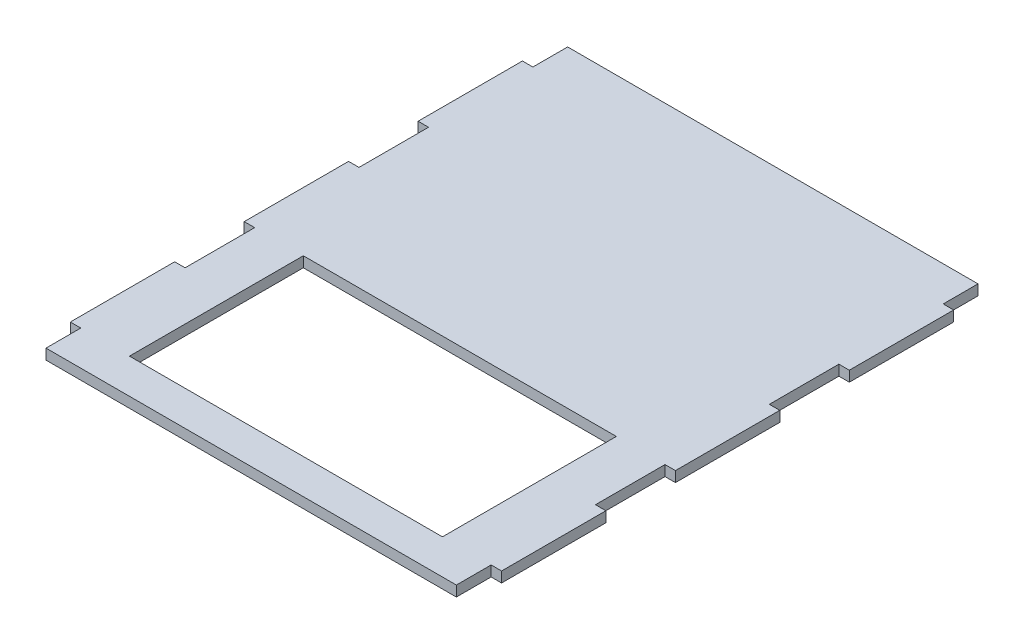
ISO-10303-21;
HEADER;
FILE_DESCRIPTION(('STEP AP214'),'2;1');
FILE_NAME('part.step','',(''),(''),'','','');
FILE_SCHEMA(('AUTOMOTIVE_DESIGN { 1 0 10303 214 1 1 1 1 }'));
ENDSEC;
DATA;
#1=APPLICATION_CONTEXT('core data for automotive mechanical design processes');
#2=APPLICATION_PROTOCOL_DEFINITION('international standard','automotive_design',2000,#1);
#3=PRODUCT_CONTEXT('',#1,'mechanical');
#4=PRODUCT('Part','Part','',(#3));
#5=PRODUCT_RELATED_PRODUCT_CATEGORY('part','',(#4));
#6=PRODUCT_DEFINITION_FORMATION('','',#4);
#7=PRODUCT_DEFINITION_CONTEXT('part definition',#1,'design');
#8=PRODUCT_DEFINITION('design','',#6,#7);
#9=PRODUCT_DEFINITION_SHAPE('','',#8);
#10=(LENGTH_UNIT() NAMED_UNIT(*) SI_UNIT(.MILLI.,.METRE.));
#11=(NAMED_UNIT(*) PLANE_ANGLE_UNIT() SI_UNIT($,.RADIAN.));
#12=(NAMED_UNIT(*) SI_UNIT($,.STERADIAN.) SOLID_ANGLE_UNIT());
#13=UNCERTAINTY_MEASURE_WITH_UNIT(LENGTH_MEASURE(1.E-05),#10,'distance_accuracy_value','');
#14=(GEOMETRIC_REPRESENTATION_CONTEXT(3) GLOBAL_UNCERTAINTY_ASSIGNED_CONTEXT((#13)) GLOBAL_UNIT_ASSIGNED_CONTEXT((#10,
#11,#12)) REPRESENTATION_CONTEXT('',''));
#15=CARTESIAN_POINT('',(0.,0.,0.));
#16=DIRECTION('',(0.,0.,1.));
#17=DIRECTION('',(1.,0.,0.));
#18=AXIS2_PLACEMENT_3D('',#15,#16,#17);
#19=CARTESIAN_POINT('',(0.,3.,0.));
#20=DIRECTION('',(0.,1.,0.));
#21=DIRECTION('',(0.,0.,1.));
#22=AXIS2_PLACEMENT_3D('',#19,#20,#21);
#23=PLANE('',#22);
#24=DIRECTION('',(0.,0.,-1.));
#25=VECTOR('',#24,1.);
#26=CARTESIAN_POINT('',(1.02695629777827E-12,3.,9.99999999999969));
#27=LINE('',#26,#25);
#28=CARTESIAN_POINT('',(1.02695629777827E-12,3.,9.99999999999969));
#29=VERTEX_POINT('',#28);
#30=CARTESIAN_POINT('',(1.02695629777827E-12,3.,0.));
#31=VERTEX_POINT('',#30);
#32=EDGE_CURVE('E278',#29,#31,#27,.T.);
#33=ORIENTED_EDGE('',*,*,#32,.T.);
#34=DIRECTION('',(-1.,0.,0.));
#35=VECTOR('',#34,1.);
#36=CARTESIAN_POINT('',(1.02695629777827E-12,3.,0.));
#37=LINE('',#36,#35);
#38=CARTESIAN_POINT('',(-117.999999999999,3.,0.));
#39=VERTEX_POINT('',#38);
#40=EDGE_CURVE('E281',#31,#39,#37,.T.);
#41=ORIENTED_EDGE('',*,*,#40,.T.);
#42=DIRECTION('',(0.,0.,-1.));
#43=VECTOR('',#42,1.);
#44=CARTESIAN_POINT('',(-117.999999999999,3.,10.));
#45=LINE('',#44,#43);
#46=CARTESIAN_POINT('',(-117.999999999999,3.,10.));
#47=VERTEX_POINT('',#46);
#48=EDGE_CURVE('E284',#47,#39,#45,.T.);
#49=ORIENTED_EDGE('',*,*,#48,.F.);
#50=DIRECTION('',(-1.,0.,0.));
#51=VECTOR('',#50,1.);
#52=CARTESIAN_POINT('',(-117.999999999999,3.,10.));
#53=LINE('',#52,#51);
#54=CARTESIAN_POINT('',(-120.999999999999,3.,10.));
#55=VERTEX_POINT('',#54);
#56=EDGE_CURVE('E287',#47,#55,#53,.T.);
#57=ORIENTED_EDGE('',*,*,#56,.T.);
#58=DIRECTION('',(0.,0.,-1.));
#59=VECTOR('',#58,1.);
#60=CARTESIAN_POINT('',(-120.999999999999,3.,40.));
#61=LINE('',#60,#59);
#62=CARTESIAN_POINT('',(-120.999999999999,3.,40.));
#63=VERTEX_POINT('',#62);
#64=EDGE_CURVE('E289',#63,#55,#61,.T.);
#65=ORIENTED_EDGE('',*,*,#64,.F.);
#66=DIRECTION('',(-1.,0.,0.));
#67=VECTOR('',#66,1.);
#68=CARTESIAN_POINT('',(-117.999999999999,3.,40.));
#69=LINE('',#68,#67);
#70=CARTESIAN_POINT('',(-117.999999999999,3.,40.));
#71=VERTEX_POINT('',#70);
#72=EDGE_CURVE('E292',#71,#63,#69,.T.);
#73=ORIENTED_EDGE('',*,*,#72,.F.);
#74=DIRECTION('',(0.,0.,-1.));
#75=VECTOR('',#74,1.);
#76=CARTESIAN_POINT('',(-118.,3.,50.0000000000001));
#77=LINE('',#76,#75);
#78=CARTESIAN_POINT('',(-118.,3.,60.));
#79=VERTEX_POINT('',#78);
#80=EDGE_CURVE('E295',#79,#71,#77,.T.);
#81=ORIENTED_EDGE('',*,*,#80,.F.);
#82=DIRECTION('',(-1.,0.,0.));
#83=VECTOR('',#82,1.);
#84=CARTESIAN_POINT('',(-118.,3.,60.));
#85=LINE('',#84,#83);
#86=CARTESIAN_POINT('',(-120.999999999997,3.,60.));
#87=VERTEX_POINT('',#86);
#88=EDGE_CURVE('E298',#79,#87,#85,.T.);
#89=ORIENTED_EDGE('',*,*,#88,.T.);
#90=DIRECTION('',(0.,0.,-1.));
#91=VECTOR('',#90,1.);
#92=CARTESIAN_POINT('',(-120.999999999997,3.,90.));
#93=LINE('',#92,#91);
#94=CARTESIAN_POINT('',(-120.999999999997,3.,90.));
#95=VERTEX_POINT('',#94);
#96=EDGE_CURVE('E300',#95,#87,#93,.T.);
#97=ORIENTED_EDGE('',*,*,#96,.F.);
#98=DIRECTION('',(-1.,0.,0.));
#99=VECTOR('',#98,1.);
#100=CARTESIAN_POINT('',(-118.,3.,90.));
#101=LINE('',#100,#99);
#102=CARTESIAN_POINT('',(-118.,3.,90.));
#103=VERTEX_POINT('',#102);
#104=EDGE_CURVE('E303',#103,#95,#101,.T.);
#105=ORIENTED_EDGE('',*,*,#104,.F.);
#106=DIRECTION('',(0.,0.,-1.));
#107=VECTOR('',#106,1.);
#108=CARTESIAN_POINT('',(-118.,3.,100.));
#109=LINE('',#108,#107);
#110=CARTESIAN_POINT('',(-118.,3.,110.));
#111=VERTEX_POINT('',#110);
#112=EDGE_CURVE('E306',#111,#103,#109,.T.);
#113=ORIENTED_EDGE('',*,*,#112,.F.);
#114=DIRECTION('',(-1.,0.,0.));
#115=VECTOR('',#114,1.);
#116=CARTESIAN_POINT('',(-118.,3.,110.));
#117=LINE('',#116,#115);
#118=CARTESIAN_POINT('',(-121.,3.,110.));
#119=VERTEX_POINT('',#118);
#120=EDGE_CURVE('E309',#111,#119,#117,.T.);
#121=ORIENTED_EDGE('',*,*,#120,.T.);
#122=DIRECTION('',(0.,0.,-1.));
#123=VECTOR('',#122,1.);
#124=CARTESIAN_POINT('',(-121.,3.,140.));
#125=LINE('',#124,#123);
#126=CARTESIAN_POINT('',(-121.,3.,140.));
#127=VERTEX_POINT('',#126);
#128=EDGE_CURVE('E311',#127,#119,#125,.T.);
#129=ORIENTED_EDGE('',*,*,#128,.F.);
#130=DIRECTION('',(-1.,0.,0.));
#131=VECTOR('',#130,1.);
#132=CARTESIAN_POINT('',(-118.,3.,140.));
#133=LINE('',#132,#131);
#134=CARTESIAN_POINT('',(-118.,3.,140.));
#135=VERTEX_POINT('',#134);
#136=EDGE_CURVE('E314',#135,#127,#133,.T.);
#137=ORIENTED_EDGE('',*,*,#136,.F.);
#138=DIRECTION('',(0.,0.,-1.));
#139=VECTOR('',#138,1.);
#140=CARTESIAN_POINT('',(-118.,3.,150.));
#141=LINE('',#140,#139);
#142=CARTESIAN_POINT('',(-118.,3.,150.));
#143=VERTEX_POINT('',#142);
#144=EDGE_CURVE('E317',#143,#135,#141,.T.);
#145=ORIENTED_EDGE('',*,*,#144,.F.);
#146=DIRECTION('',(-1.,0.,0.));
#147=VECTOR('',#146,1.);
#148=CARTESIAN_POINT('',(0.,3.,150.));
#149=LINE('',#148,#147);
#150=CARTESIAN_POINT('',(0.,3.,150.));
#151=VERTEX_POINT('',#150);
#152=EDGE_CURVE('E320',#151,#143,#149,.T.);
#153=ORIENTED_EDGE('',*,*,#152,.F.);
#154=DIRECTION('',(0.,0.,-1.));
#155=VECTOR('',#154,1.);
#156=CARTESIAN_POINT('',(0.,3.,150.));
#157=LINE('',#156,#155);
#158=CARTESIAN_POINT('',(0.,3.,140.));
#159=VERTEX_POINT('',#158);
#160=EDGE_CURVE('E323',#151,#159,#157,.T.);
#161=ORIENTED_EDGE('',*,*,#160,.T.);
#162=DIRECTION('',(1.,0.,0.));
#163=VECTOR('',#162,1.);
#164=CARTESIAN_POINT('',(0.,3.,140.));
#165=LINE('',#164,#163);
#166=CARTESIAN_POINT('',(3.00000000000017,3.,140.));
#167=VERTEX_POINT('',#166);
#168=EDGE_CURVE('E325',#159,#167,#165,.T.);
#169=ORIENTED_EDGE('',*,*,#168,.T.);
#170=DIRECTION('',(0.,0.,-1.));
#171=VECTOR('',#170,1.);
#172=CARTESIAN_POINT('',(3.00000000000017,3.,140.));
#173=LINE('',#172,#171);
#174=CARTESIAN_POINT('',(3.00000000000017,3.,110.));
#175=VERTEX_POINT('',#174);
#176=EDGE_CURVE('E327',#167,#175,#173,.T.);
#177=ORIENTED_EDGE('',*,*,#176,.T.);
#178=DIRECTION('',(1.,0.,0.));
#179=VECTOR('',#178,1.);
#180=CARTESIAN_POINT('',(0.,3.,110.));
#181=LINE('',#180,#179);
#182=CARTESIAN_POINT('',(0.,3.,110.));
#183=VERTEX_POINT('',#182);
#184=EDGE_CURVE('E329',#183,#175,#181,.T.);
#185=ORIENTED_EDGE('',*,*,#184,.F.);
#186=DIRECTION('',(0.,0.,-1.));
#187=VECTOR('',#186,1.);
#188=CARTESIAN_POINT('',(0.,3.,110.));
#189=LINE('',#188,#187);
#190=CARTESIAN_POINT('',(0.,3.,89.9999999999997));
#191=VERTEX_POINT('',#190);
#192=EDGE_CURVE('E332',#183,#191,#189,.T.);
#193=ORIENTED_EDGE('',*,*,#192,.T.);
#194=DIRECTION('',(1.,0.,0.));
#195=VECTOR('',#194,1.);
#196=CARTESIAN_POINT('',(0.,3.,89.9999999999997));
#197=LINE('',#196,#195);
#198=CARTESIAN_POINT('',(2.99999999999681,3.,89.9999999999997));
#199=VERTEX_POINT('',#198);
#200=EDGE_CURVE('E334',#191,#199,#197,.T.);
#201=ORIENTED_EDGE('',*,*,#200,.T.);
#202=DIRECTION('',(0.,0.,-1.));
#203=VECTOR('',#202,1.);
#204=CARTESIAN_POINT('',(2.99999999999681,3.,89.9999999999997));
#205=LINE('',#204,#203);
#206=CARTESIAN_POINT('',(2.99999999999681,3.,59.9999999999997));
#207=VERTEX_POINT('',#206);
#208=EDGE_CURVE('E336',#199,#207,#205,.T.);
#209=ORIENTED_EDGE('',*,*,#208,.T.);
#210=DIRECTION('',(1.,0.,0.));
#211=VECTOR('',#210,1.);
#212=CARTESIAN_POINT('',(-3.3584246494911E-12,3.,59.9999999999997));
#213=LINE('',#212,#211);
#214=CARTESIAN_POINT('',(-3.3584246494911E-12,3.,59.9999999999997));
#215=VERTEX_POINT('',#214);
#216=EDGE_CURVE('E338',#215,#207,#213,.T.);
#217=ORIENTED_EDGE('',*,*,#216,.F.);
#218=DIRECTION('',(0.,0.,-1.));
#219=VECTOR('',#218,1.);
#220=CARTESIAN_POINT('',(-3.3584246494911E-12,3.,59.9999999999997));
#221=LINE('',#220,#219);
#222=CARTESIAN_POINT('',(-3.3584246494911E-12,3.,39.9999999999997));
#223=VERTEX_POINT('',#222);
#224=EDGE_CURVE('E341',#215,#223,#221,.T.);
#225=ORIENTED_EDGE('',*,*,#224,.T.);
#226=DIRECTION('',(1.,0.,0.));
#227=VECTOR('',#226,1.);
#228=CARTESIAN_POINT('',(-3.3584246494911E-12,3.,39.9999999999997));
#229=LINE('',#228,#227);
#230=CARTESIAN_POINT('',(2.99999999999606,3.,39.9999999999997));
#231=VERTEX_POINT('',#230);
#232=EDGE_CURVE('E343',#223,#231,#229,.T.);
#233=ORIENTED_EDGE('',*,*,#232,.T.);
#234=DIRECTION('',(0.,0.,-1.));
#235=VECTOR('',#234,1.);
#236=CARTESIAN_POINT('',(2.99999999999606,3.,39.9999999999997));
#237=LINE('',#236,#235);
#238=CARTESIAN_POINT('',(2.99999999999606,3.,9.99999999999969));
#239=VERTEX_POINT('',#238);
#240=EDGE_CURVE('E345',#231,#239,#237,.T.);
#241=ORIENTED_EDGE('',*,*,#240,.T.);
#242=DIRECTION('',(1.,0.,0.));
#243=VECTOR('',#242,1.);
#244=CARTESIAN_POINT('',(1.02695629777827E-12,3.,9.99999999999969));
#245=LINE('',#244,#243);
#246=EDGE_CURVE('E347',#29,#239,#245,.T.);
#247=ORIENTED_EDGE('',*,*,#246,.F.);
#248=EDGE_LOOP('',(#33,#41,#49,#57,#65,#73,#81,#89,#97,#105,#113,#121,#129,#137,#145,#153,#161,
#169,#177,#185,#193,#201,#209,#217,#225,#233,#241,#247));
#249=FACE_BOUND('',#248,.T.);
#250=DIRECTION('',(0.,0.,-1.));
#251=VECTOR('',#250,1.);
#252=CARTESIAN_POINT('',(-13.9999999999999,3.,140.));
#253=LINE('',#252,#251);
#254=CARTESIAN_POINT('',(-13.9999999999999,3.,140.));
#255=VERTEX_POINT('',#254);
#256=CARTESIAN_POINT('',(-13.9999999999999,3.,90.));
#257=VERTEX_POINT('',#256);
#258=EDGE_CURVE('E252',#255,#257,#253,.T.);
#259=ORIENTED_EDGE('',*,*,#258,.F.);
#260=DIRECTION('',(1.,0.,0.));
#261=VECTOR('',#260,1.);
#262=CARTESIAN_POINT('',(-104.,3.,140.));
#263=LINE('',#262,#261);
#264=CARTESIAN_POINT('',(-104.,3.,140.));
#265=VERTEX_POINT('',#264);
#266=EDGE_CURVE('E243',#265,#255,#263,.T.);
#267=ORIENTED_EDGE('',*,*,#266,.F.);
#268=DIRECTION('',(0.,0.,-1.));
#269=VECTOR('',#268,1.);
#270=CARTESIAN_POINT('',(-104.,3.,140.));
#271=LINE('',#270,#269);
#272=CARTESIAN_POINT('',(-104.,3.,90.));
#273=VERTEX_POINT('',#272);
#274=EDGE_CURVE('E263',#265,#273,#271,.T.);
#275=ORIENTED_EDGE('',*,*,#274,.T.);
#276=DIRECTION('',(1.,0.,0.));
#277=VECTOR('',#276,1.);
#278=CARTESIAN_POINT('',(-104.,3.,90.));
#279=LINE('',#278,#277);
#280=EDGE_CURVE('E49',#273,#257,#279,.T.);
#281=ORIENTED_EDGE('',*,*,#280,.T.);
#282=EDGE_LOOP('',(#259,#267,#275,#281));
#283=FACE_BOUND('',#282,.T.);
#284=ADVANCED_FACE('F34',(#249,#283),#23,.T.);
#285=CARTESIAN_POINT('',(0.,0.,0.));
#286=DIRECTION('',(0.,1.,0.));
#287=DIRECTION('',(0.,0.,1.));
#288=AXIS2_PLACEMENT_3D('',#285,#286,#287);
#289=PLANE('',#288);
#290=DIRECTION('',(0.,0.,-1.));
#291=VECTOR('',#290,1.);
#292=CARTESIAN_POINT('',(1.02695629777827E-12,0.,9.99999999999969));
#293=LINE('',#292,#291);
#294=CARTESIAN_POINT('',(1.02695629777827E-12,0.,9.99999999999969));
#295=VERTEX_POINT('',#294);
#296=CARTESIAN_POINT('',(1.02695629777827E-12,0.,0.));
#297=VERTEX_POINT('',#296);
#298=EDGE_CURVE('E259',#295,#297,#293,.T.);
#299=ORIENTED_EDGE('',*,*,#298,.F.);
#300=DIRECTION('',(1.,0.,0.));
#301=VECTOR('',#300,1.);
#302=CARTESIAN_POINT('',(1.02695629777827E-12,0.,9.99999999999969));
#303=LINE('',#302,#301);
#304=CARTESIAN_POINT('',(2.99999999999606,0.,9.99999999999969));
#305=VERTEX_POINT('',#304);
#306=EDGE_CURVE('E282',#295,#305,#303,.T.);
#307=ORIENTED_EDGE('',*,*,#306,.T.);
#308=DIRECTION('',(0.,0.,-1.));
#309=VECTOR('',#308,1.);
#310=CARTESIAN_POINT('',(2.99999999999606,0.,39.9999999999997));
#311=LINE('',#310,#309);
#312=CARTESIAN_POINT('',(2.99999999999606,0.,39.9999999999997));
#313=VERTEX_POINT('',#312);
#314=EDGE_CURVE('E420',#313,#305,#311,.T.);
#315=ORIENTED_EDGE('',*,*,#314,.F.);
#316=DIRECTION('',(1.,0.,0.));
#317=VECTOR('',#316,1.);
#318=CARTESIAN_POINT('',(-3.3584246494911E-12,0.,39.9999999999997));
#319=LINE('',#318,#317);
#320=CARTESIAN_POINT('',(-3.3584246494911E-12,0.,39.9999999999997));
#321=VERTEX_POINT('',#320);
#322=EDGE_CURVE('E418',#321,#313,#319,.T.);
#323=ORIENTED_EDGE('',*,*,#322,.F.);
#324=DIRECTION('',(0.,0.,-1.));
#325=VECTOR('',#324,1.);
#326=CARTESIAN_POINT('',(-3.3584246494911E-12,0.,49.9999999999997));
#327=LINE('',#326,#325);
#328=CARTESIAN_POINT('',(-3.3584246494911E-12,0.,59.9999999999997));
#329=VERTEX_POINT('',#328);
#330=EDGE_CURVE('E416',#329,#321,#327,.T.);
#331=ORIENTED_EDGE('',*,*,#330,.F.);
#332=DIRECTION('',(1.,0.,0.));
#333=VECTOR('',#332,1.);
#334=CARTESIAN_POINT('',(-3.3584246494911E-12,0.,59.9999999999997));
#335=LINE('',#334,#333);
#336=CARTESIAN_POINT('',(2.99999999999681,0.,59.9999999999997));
#337=VERTEX_POINT('',#336);
#338=EDGE_CURVE('E413',#329,#337,#335,.T.);
#339=ORIENTED_EDGE('',*,*,#338,.T.);
#340=DIRECTION('',(0.,0.,-1.));
#341=VECTOR('',#340,1.);
#342=CARTESIAN_POINT('',(2.99999999999681,0.,89.9999999999997));
#343=LINE('',#342,#341);
#344=CARTESIAN_POINT('',(2.99999999999681,0.,89.9999999999997));
#345=VERTEX_POINT('',#344);
#346=EDGE_CURVE('E410',#345,#337,#343,.T.);
#347=ORIENTED_EDGE('',*,*,#346,.F.);
#348=DIRECTION('',(1.,0.,0.));
#349=VECTOR('',#348,1.);
#350=CARTESIAN_POINT('',(0.,0.,89.9999999999997));
#351=LINE('',#350,#349);
#352=CARTESIAN_POINT('',(0.,0.,89.9999999999997));
#353=VERTEX_POINT('',#352);
#354=EDGE_CURVE('E408',#353,#345,#351,.T.);
#355=ORIENTED_EDGE('',*,*,#354,.F.);
#356=DIRECTION('',(0.,0.,-1.));
#357=VECTOR('',#356,1.);
#358=CARTESIAN_POINT('',(0.,0.,100.));
#359=LINE('',#358,#357);
#360=CARTESIAN_POINT('',(0.,0.,110.));
#361=VERTEX_POINT('',#360);
#362=EDGE_CURVE('E406',#361,#353,#359,.T.);
#363=ORIENTED_EDGE('',*,*,#362,.F.);
#364=DIRECTION('',(1.,0.,0.));
#365=VECTOR('',#364,1.);
#366=CARTESIAN_POINT('',(0.,0.,110.));
#367=LINE('',#366,#365);
#368=CARTESIAN_POINT('',(3.00000000000017,0.,110.));
#369=VERTEX_POINT('',#368);
#370=EDGE_CURVE('E403',#361,#369,#367,.T.);
#371=ORIENTED_EDGE('',*,*,#370,.T.);
#372=DIRECTION('',(0.,0.,-1.));
#373=VECTOR('',#372,1.);
#374=CARTESIAN_POINT('',(3.00000000000017,0.,140.));
#375=LINE('',#374,#373);
#376=CARTESIAN_POINT('',(3.00000000000017,0.,140.));
#377=VERTEX_POINT('',#376);
#378=EDGE_CURVE('E400',#377,#369,#375,.T.);
#379=ORIENTED_EDGE('',*,*,#378,.F.);
#380=DIRECTION('',(1.,0.,0.));
#381=VECTOR('',#380,1.);
#382=CARTESIAN_POINT('',(0.,0.,140.));
#383=LINE('',#382,#381);
#384=CARTESIAN_POINT('',(0.,0.,140.));
#385=VERTEX_POINT('',#384);
#386=EDGE_CURVE('E398',#385,#377,#383,.T.);
#387=ORIENTED_EDGE('',*,*,#386,.F.);
#388=DIRECTION('',(0.,0.,-1.));
#389=VECTOR('',#388,1.);
#390=CARTESIAN_POINT('',(0.,0.,150.));
#391=LINE('',#390,#389);
#392=CARTESIAN_POINT('',(0.,0.,150.));
#393=VERTEX_POINT('',#392);
#394=EDGE_CURVE('E396',#393,#385,#391,.T.);
#395=ORIENTED_EDGE('',*,*,#394,.F.);
#396=DIRECTION('',(-1.,0.,0.));
#397=VECTOR('',#396,1.);
#398=CARTESIAN_POINT('',(0.,0.,150.));
#399=LINE('',#398,#397);
#400=CARTESIAN_POINT('',(-118.,0.,150.));
#401=VERTEX_POINT('',#400);
#402=EDGE_CURVE('E393',#393,#401,#399,.T.);
#403=ORIENTED_EDGE('',*,*,#402,.T.);
#404=DIRECTION('',(0.,0.,-1.));
#405=VECTOR('',#404,1.);
#406=CARTESIAN_POINT('',(-118.,0.,150.));
#407=LINE('',#406,#405);
#408=CARTESIAN_POINT('',(-118.,0.,140.));
#409=VERTEX_POINT('',#408);
#410=EDGE_CURVE('E390',#401,#409,#407,.T.);
#411=ORIENTED_EDGE('',*,*,#410,.T.);
#412=DIRECTION('',(-1.,0.,0.));
#413=VECTOR('',#412,1.);
#414=CARTESIAN_POINT('',(-118.,0.,140.));
#415=LINE('',#414,#413);
#416=CARTESIAN_POINT('',(-121.,0.,140.));
#417=VERTEX_POINT('',#416);
#418=EDGE_CURVE('E387',#409,#417,#415,.T.);
#419=ORIENTED_EDGE('',*,*,#418,.T.);
#420=DIRECTION('',(0.,0.,-1.));
#421=VECTOR('',#420,1.);
#422=CARTESIAN_POINT('',(-121.,0.,140.));
#423=LINE('',#422,#421);
#424=CARTESIAN_POINT('',(-121.,0.,110.));
#425=VERTEX_POINT('',#424);
#426=EDGE_CURVE('E384',#417,#425,#423,.T.);
#427=ORIENTED_EDGE('',*,*,#426,.T.);
#428=DIRECTION('',(-1.,0.,0.));
#429=VECTOR('',#428,1.);
#430=CARTESIAN_POINT('',(-118.,0.,110.));
#431=LINE('',#430,#429);
#432=CARTESIAN_POINT('',(-118.,0.,110.));
#433=VERTEX_POINT('',#432);
#434=EDGE_CURVE('E381',#433,#425,#431,.T.);
#435=ORIENTED_EDGE('',*,*,#434,.F.);
#436=DIRECTION('',(0.,0.,-1.));
#437=VECTOR('',#436,1.);
#438=CARTESIAN_POINT('',(-118.,0.,110.));
#439=LINE('',#438,#437);
#440=CARTESIAN_POINT('',(-118.,0.,90.));
#441=VERTEX_POINT('',#440);
#442=EDGE_CURVE('E379',#433,#441,#439,.T.);
#443=ORIENTED_EDGE('',*,*,#442,.T.);
#444=DIRECTION('',(-1.,0.,0.));
#445=VECTOR('',#444,1.);
#446=CARTESIAN_POINT('',(-118.,0.,90.));
#447=LINE('',#446,#445);
#448=CARTESIAN_POINT('',(-120.999999999997,0.,90.));
#449=VERTEX_POINT('',#448);
#450=EDGE_CURVE('E376',#441,#449,#447,.T.);
#451=ORIENTED_EDGE('',*,*,#450,.T.);
#452=DIRECTION('',(0.,0.,-1.));
#453=VECTOR('',#452,1.);
#454=CARTESIAN_POINT('',(-120.999999999997,0.,90.));
#455=LINE('',#454,#453);
#456=CARTESIAN_POINT('',(-120.999999999997,0.,60.));
#457=VERTEX_POINT('',#456);
#458=EDGE_CURVE('E373',#449,#457,#455,.T.);
#459=ORIENTED_EDGE('',*,*,#458,.T.);
#460=DIRECTION('',(-1.,0.,0.));
#461=VECTOR('',#460,1.);
#462=CARTESIAN_POINT('',(-118.,0.,60.));
#463=LINE('',#462,#461);
#464=CARTESIAN_POINT('',(-118.,0.,60.));
#465=VERTEX_POINT('',#464);
#466=EDGE_CURVE('E370',#465,#457,#463,.T.);
#467=ORIENTED_EDGE('',*,*,#466,.F.);
#468=DIRECTION('',(0.,0.,-1.));
#469=VECTOR('',#468,1.);
#470=CARTESIAN_POINT('',(-118.,0.,60.));
#471=LINE('',#470,#469);
#472=CARTESIAN_POINT('',(-117.999999999999,0.,40.));
#473=VERTEX_POINT('',#472);
#474=EDGE_CURVE('E368',#465,#473,#471,.T.);
#475=ORIENTED_EDGE('',*,*,#474,.T.);
#476=DIRECTION('',(-1.,0.,0.));
#477=VECTOR('',#476,1.);
#478=CARTESIAN_POINT('',(-117.999999999999,0.,40.));
#479=LINE('',#478,#477);
#480=CARTESIAN_POINT('',(-120.999999999999,0.,40.));
#481=VERTEX_POINT('',#480);
#482=EDGE_CURVE('E365',#473,#481,#479,.T.);
#483=ORIENTED_EDGE('',*,*,#482,.T.);
#484=DIRECTION('',(0.,0.,-1.));
#485=VECTOR('',#484,1.);
#486=CARTESIAN_POINT('',(-120.999999999999,0.,40.));
#487=LINE('',#486,#485);
#488=CARTESIAN_POINT('',(-120.999999999999,0.,10.));
#489=VERTEX_POINT('',#488);
#490=EDGE_CURVE('E362',#481,#489,#487,.T.);
#491=ORIENTED_EDGE('',*,*,#490,.T.);
#492=DIRECTION('',(-1.,0.,0.));
#493=VECTOR('',#492,1.);
#494=CARTESIAN_POINT('',(-117.999999999999,0.,10.));
#495=LINE('',#494,#493);
#496=CARTESIAN_POINT('',(-117.999999999999,0.,10.));
#497=VERTEX_POINT('',#496);
#498=EDGE_CURVE('E359',#497,#489,#495,.T.);
#499=ORIENTED_EDGE('',*,*,#498,.F.);
#500=DIRECTION('',(0.,0.,-1.));
#501=VECTOR('',#500,1.);
#502=CARTESIAN_POINT('',(-117.999999999999,0.,10.));
#503=LINE('',#502,#501);
#504=CARTESIAN_POINT('',(-117.999999999999,0.,0.));
#505=VERTEX_POINT('',#504);
#506=EDGE_CURVE('E356',#497,#505,#503,.T.);
#507=ORIENTED_EDGE('',*,*,#506,.T.);
#508=DIRECTION('',(-1.,0.,0.));
#509=VECTOR('',#508,1.);
#510=CARTESIAN_POINT('',(1.02695629777827E-12,0.,0.));
#511=LINE('',#510,#509);
#512=EDGE_CURVE('E353',#297,#505,#511,.T.);
#513=ORIENTED_EDGE('',*,*,#512,.F.);
#514=EDGE_LOOP('',(#299,#307,#315,#323,#331,#339,#347,#355,#363,#371,#379,#387,#395,#403,#411,
#419,#427,#435,#443,#451,#459,#467,#475,#483,#491,#499,#507,#513));
#515=FACE_BOUND('',#514,.T.);
#516=DIRECTION('',(1.,0.,0.));
#517=VECTOR('',#516,1.);
#518=CARTESIAN_POINT('',(-104.,0.,140.));
#519=LINE('',#518,#517);
#520=CARTESIAN_POINT('',(-104.,0.,140.));
#521=VERTEX_POINT('',#520);
#522=CARTESIAN_POINT('',(-13.9999999999999,0.,140.));
#523=VERTEX_POINT('',#522);
#524=EDGE_CURVE('E57',#521,#523,#519,.T.);
#525=ORIENTED_EDGE('',*,*,#524,.T.);
#526=DIRECTION('',(0.,0.,-1.));
#527=VECTOR('',#526,1.);
#528=CARTESIAN_POINT('',(-13.9999999999999,0.,140.));
#529=LINE('',#528,#527);
#530=CARTESIAN_POINT('',(-13.9999999999999,0.,90.));
#531=VERTEX_POINT('',#530);
#532=EDGE_CURVE('E258',#523,#531,#529,.T.);
#533=ORIENTED_EDGE('',*,*,#532,.T.);
#534=DIRECTION('',(1.,0.,0.));
#535=VECTOR('',#534,1.);
#536=CARTESIAN_POINT('',(-104.,0.,90.));
#537=LINE('',#536,#535);
#538=CARTESIAN_POINT('',(-104.,0.,90.));
#539=VERTEX_POINT('',#538);
#540=EDGE_CURVE('E269',#539,#531,#537,.T.);
#541=ORIENTED_EDGE('',*,*,#540,.F.);
#542=DIRECTION('',(0.,0.,-1.));
#543=VECTOR('',#542,1.);
#544=CARTESIAN_POINT('',(-104.,0.,140.));
#545=LINE('',#544,#543);
#546=EDGE_CURVE('E253',#521,#539,#545,.T.);
#547=ORIENTED_EDGE('',*,*,#546,.F.);
#548=EDGE_LOOP('',(#525,#533,#541,#547));
#549=FACE_BOUND('',#548,.T.);
#550=ADVANCED_FACE('F496',(#515,#549),#289,.F.);
#551=CARTESIAN_POINT('',(1.02695629777827E-12,3.,9.99999999999969));
#552=DIRECTION('',(-1.,0.,0.));
#553=DIRECTION('',(0.,0.,1.));
#554=AXIS2_PLACEMENT_3D('',#551,#552,#553);
#555=PLANE('',#554);
#556=ORIENTED_EDGE('',*,*,#298,.T.);
#557=DIRECTION('',(0.,-1.,0.));
#558=VECTOR('',#557,1.);
#559=CARTESIAN_POINT('',(1.02695629777827E-12,3.,0.));
#560=LINE('',#559,#558);
#561=EDGE_CURVE('E11',#31,#297,#560,.T.);
#562=ORIENTED_EDGE('',*,*,#561,.F.);
#563=ORIENTED_EDGE('',*,*,#32,.F.);
#564=DIRECTION('',(0.,-1.,0.));
#565=VECTOR('',#564,1.);
#566=CARTESIAN_POINT('',(1.02695629777827E-12,3.,9.99999999999969));
#567=LINE('',#566,#565);
#568=EDGE_CURVE('E350',#29,#295,#567,.T.);
#569=ORIENTED_EDGE('',*,*,#568,.T.);
#570=EDGE_LOOP('',(#556,#562,#563,#569));
#571=FACE_BOUND('',#570,.T.);
#572=ADVANCED_FACE('F36',(#571),#555,.F.);
#573=CARTESIAN_POINT('',(1.02695629777827E-12,3.,0.));
#574=DIRECTION('',(0.,0.,1.));
#575=DIRECTION('',(1.,0.,0.));
#576=AXIS2_PLACEMENT_3D('',#573,#574,#575);
#577=PLANE('',#576);
#578=ORIENTED_EDGE('',*,*,#512,.T.);
#579=DIRECTION('',(0.,-1.,0.));
#580=VECTOR('',#579,1.);
#581=CARTESIAN_POINT('',(-117.999999999999,3.,0.));
#582=LINE('',#581,#580);
#583=EDGE_CURVE('E42',#39,#505,#582,.T.);
#584=ORIENTED_EDGE('',*,*,#583,.F.);
#585=ORIENTED_EDGE('',*,*,#40,.F.);
#586=ORIENTED_EDGE('',*,*,#561,.T.);
#587=EDGE_LOOP('',(#578,#584,#585,#586));
#588=FACE_BOUND('',#587,.T.);
#589=ADVANCED_FACE('F491',(#588),#577,.F.);
#590=CARTESIAN_POINT('',(-117.999999999999,3.,10.));
#591=DIRECTION('',(-1.,0.,0.));
#592=DIRECTION('',(0.,0.,1.));
#593=AXIS2_PLACEMENT_3D('',#590,#591,#592);
#594=PLANE('',#593);
#595=ORIENTED_EDGE('',*,*,#506,.F.);
#596=DIRECTION('',(0.,-1.,0.));
#597=VECTOR('',#596,1.);
#598=CARTESIAN_POINT('',(-117.999999999999,3.,10.));
#599=LINE('',#598,#597);
#600=EDGE_CURVE('E484',#47,#497,#599,.T.);
#601=ORIENTED_EDGE('',*,*,#600,.F.);
#602=ORIENTED_EDGE('',*,*,#48,.T.);
#603=ORIENTED_EDGE('',*,*,#583,.T.);
#604=EDGE_LOOP('',(#595,#601,#602,#603));
#605=FACE_BOUND('',#604,.T.);
#606=ADVANCED_FACE('F488',(#605),#594,.T.);
#607=CARTESIAN_POINT('',(-117.999999999999,3.,10.));
#608=DIRECTION('',(0.,0.,1.));
#609=DIRECTION('',(1.,0.,0.));
#610=AXIS2_PLACEMENT_3D('',#607,#608,#609);
#611=PLANE('',#610);
#612=ORIENTED_EDGE('',*,*,#498,.T.);
#613=DIRECTION('',(0.,-1.,0.));
#614=VECTOR('',#613,1.);
#615=CARTESIAN_POINT('',(-120.999999999999,3.,10.));
#616=LINE('',#615,#614);
#617=EDGE_CURVE('E482',#55,#489,#616,.T.);
#618=ORIENTED_EDGE('',*,*,#617,.F.);
#619=ORIENTED_EDGE('',*,*,#56,.F.);
#620=ORIENTED_EDGE('',*,*,#600,.T.);
#621=EDGE_LOOP('',(#612,#618,#619,#620));
#622=FACE_BOUND('',#621,.T.);
#623=ADVANCED_FACE('F501',(#622),#611,.F.);
#624=CARTESIAN_POINT('',(-120.999999999999,3.,40.));
#625=DIRECTION('',(-1.,0.,0.));
#626=DIRECTION('',(0.,0.,1.));
#627=AXIS2_PLACEMENT_3D('',#624,#625,#626);
#628=PLANE('',#627);
#629=ORIENTED_EDGE('',*,*,#490,.F.);
#630=DIRECTION('',(0.,-1.,0.));
#631=VECTOR('',#630,1.);
#632=CARTESIAN_POINT('',(-120.999999999999,3.,40.));
#633=LINE('',#632,#631);
#634=EDGE_CURVE('E480',#63,#481,#633,.T.);
#635=ORIENTED_EDGE('',*,*,#634,.F.);
#636=ORIENTED_EDGE('',*,*,#64,.T.);
#637=ORIENTED_EDGE('',*,*,#617,.T.);
#638=EDGE_LOOP('',(#629,#635,#636,#637));
#639=FACE_BOUND('',#638,.T.);
#640=ADVANCED_FACE('F608',(#639),#628,.T.);
#641=CARTESIAN_POINT('',(-117.999999999999,3.,40.));
#642=DIRECTION('',(0.,0.,1.));
#643=DIRECTION('',(1.,0.,0.));
#644=AXIS2_PLACEMENT_3D('',#641,#642,#643);
#645=PLANE('',#644);
#646=ORIENTED_EDGE('',*,*,#482,.F.);
#647=DIRECTION('',(0.,-1.,0.));
#648=VECTOR('',#647,1.);
#649=CARTESIAN_POINT('',(-117.999999999999,3.,40.));
#650=LINE('',#649,#648);
#651=EDGE_CURVE('E477',#71,#473,#650,.T.);
#652=ORIENTED_EDGE('',*,*,#651,.F.);
#653=ORIENTED_EDGE('',*,*,#72,.T.);
#654=ORIENTED_EDGE('',*,*,#634,.T.);
#655=EDGE_LOOP('',(#646,#652,#653,#654));
#656=FACE_BOUND('',#655,.T.);
#657=ADVANCED_FACE('F605',(#656),#645,.T.);
#658=CARTESIAN_POINT('',(-118.,3.,60.));
#659=DIRECTION('',(-1.,0.,0.));
#660=DIRECTION('',(0.,0.,1.));
#661=AXIS2_PLACEMENT_3D('',#658,#659,#660);
#662=PLANE('',#661);
#663=ORIENTED_EDGE('',*,*,#474,.F.);
#664=DIRECTION('',(0.,-1.,0.));
#665=VECTOR('',#664,1.);
#666=CARTESIAN_POINT('',(-118.,3.,60.));
#667=LINE('',#666,#665);
#668=EDGE_CURVE('E475',#79,#465,#667,.T.);
#669=ORIENTED_EDGE('',*,*,#668,.F.);
#670=ORIENTED_EDGE('',*,*,#80,.T.);
#671=ORIENTED_EDGE('',*,*,#651,.T.);
#672=EDGE_LOOP('',(#663,#669,#670,#671));
#673=FACE_BOUND('',#672,.T.);
#674=ADVANCED_FACE('F602',(#673),#662,.T.);
#675=CARTESIAN_POINT('',(-118.,3.,60.));
#676=DIRECTION('',(0.,0.,1.));
#677=DIRECTION('',(1.,0.,0.));
#678=AXIS2_PLACEMENT_3D('',#675,#676,#677);
#679=PLANE('',#678);
#680=ORIENTED_EDGE('',*,*,#466,.T.);
#681=DIRECTION('',(0.,-1.,0.));
#682=VECTOR('',#681,1.);
#683=CARTESIAN_POINT('',(-120.999999999997,3.,60.));
#684=LINE('',#683,#682);
#685=EDGE_CURVE('E473',#87,#457,#684,.T.);
#686=ORIENTED_EDGE('',*,*,#685,.F.);
#687=ORIENTED_EDGE('',*,*,#88,.F.);
#688=ORIENTED_EDGE('',*,*,#668,.T.);
#689=EDGE_LOOP('',(#680,#686,#687,#688));
#690=FACE_BOUND('',#689,.T.);
#691=ADVANCED_FACE('F599',(#690),#679,.F.);
#692=CARTESIAN_POINT('',(-120.999999999997,3.,90.));
#693=DIRECTION('',(-1.,0.,0.));
#694=DIRECTION('',(0.,0.,1.));
#695=AXIS2_PLACEMENT_3D('',#692,#693,#694);
#696=PLANE('',#695);
#697=ORIENTED_EDGE('',*,*,#458,.F.);
#698=DIRECTION('',(0.,-1.,0.));
#699=VECTOR('',#698,1.);
#700=CARTESIAN_POINT('',(-120.999999999997,3.,90.));
#701=LINE('',#700,#699);
#702=EDGE_CURVE('E471',#95,#449,#701,.T.);
#703=ORIENTED_EDGE('',*,*,#702,.F.);
#704=ORIENTED_EDGE('',*,*,#96,.T.);
#705=ORIENTED_EDGE('',*,*,#685,.T.);
#706=EDGE_LOOP('',(#697,#703,#704,#705));
#707=FACE_BOUND('',#706,.T.);
#708=ADVANCED_FACE('F594',(#707),#696,.T.);
#709=CARTESIAN_POINT('',(-118.,3.,90.));
#710=DIRECTION('',(0.,0.,1.));
#711=DIRECTION('',(1.,0.,0.));
#712=AXIS2_PLACEMENT_3D('',#709,#710,#711);
#713=PLANE('',#712);
#714=ORIENTED_EDGE('',*,*,#450,.F.);
#715=DIRECTION('',(0.,-1.,0.));
#716=VECTOR('',#715,1.);
#717=CARTESIAN_POINT('',(-118.,3.,90.));
#718=LINE('',#717,#716);
#719=EDGE_CURVE('E468',#103,#441,#718,.T.);
#720=ORIENTED_EDGE('',*,*,#719,.F.);
#721=ORIENTED_EDGE('',*,*,#104,.T.);
#722=ORIENTED_EDGE('',*,*,#702,.T.);
#723=EDGE_LOOP('',(#714,#720,#721,#722));
#724=FACE_BOUND('',#723,.T.);
#725=ADVANCED_FACE('F589',(#724),#713,.T.);
#726=CARTESIAN_POINT('',(-118.,3.,110.));
#727=DIRECTION('',(-1.,0.,0.));
#728=DIRECTION('',(0.,0.,1.));
#729=AXIS2_PLACEMENT_3D('',#726,#727,#728);
#730=PLANE('',#729);
#731=ORIENTED_EDGE('',*,*,#442,.F.);
#732=DIRECTION('',(0.,-1.,0.));
#733=VECTOR('',#732,1.);
#734=CARTESIAN_POINT('',(-118.,3.,110.));
#735=LINE('',#734,#733);
#736=EDGE_CURVE('E466',#111,#433,#735,.T.);
#737=ORIENTED_EDGE('',*,*,#736,.F.);
#738=ORIENTED_EDGE('',*,*,#112,.T.);
#739=ORIENTED_EDGE('',*,*,#719,.T.);
#740=EDGE_LOOP('',(#731,#737,#738,#739));
#741=FACE_BOUND('',#740,.T.);
#742=ADVANCED_FACE('F585',(#741),#730,.T.);
#743=CARTESIAN_POINT('',(-118.,3.,110.));
#744=DIRECTION('',(0.,0.,1.));
#745=DIRECTION('',(1.,0.,0.));
#746=AXIS2_PLACEMENT_3D('',#743,#744,#745);
#747=PLANE('',#746);
#748=ORIENTED_EDGE('',*,*,#434,.T.);
#749=DIRECTION('',(0.,-1.,0.));
#750=VECTOR('',#749,1.);
#751=CARTESIAN_POINT('',(-121.,3.,110.));
#752=LINE('',#751,#750);
#753=EDGE_CURVE('E464',#119,#425,#752,.T.);
#754=ORIENTED_EDGE('',*,*,#753,.F.);
#755=ORIENTED_EDGE('',*,*,#120,.F.);
#756=ORIENTED_EDGE('',*,*,#736,.T.);
#757=EDGE_LOOP('',(#748,#754,#755,#756));
#758=FACE_BOUND('',#757,.T.);
#759=ADVANCED_FACE('F581',(#758),#747,.F.);
#760=CARTESIAN_POINT('',(-121.,3.,140.));
#761=DIRECTION('',(-1.,0.,0.));
#762=DIRECTION('',(0.,0.,1.));
#763=AXIS2_PLACEMENT_3D('',#760,#761,#762);
#764=PLANE('',#763);
#765=ORIENTED_EDGE('',*,*,#426,.F.);
#766=DIRECTION('',(0.,-1.,0.));
#767=VECTOR('',#766,1.);
#768=CARTESIAN_POINT('',(-121.,3.,140.));
#769=LINE('',#768,#767);
#770=EDGE_CURVE('E462',#127,#417,#769,.T.);
#771=ORIENTED_EDGE('',*,*,#770,.F.);
#772=ORIENTED_EDGE('',*,*,#128,.T.);
#773=ORIENTED_EDGE('',*,*,#753,.T.);
#774=EDGE_LOOP('',(#765,#771,#772,#773));
#775=FACE_BOUND('',#774,.T.);
#776=ADVANCED_FACE('F577',(#775),#764,.T.);
#777=CARTESIAN_POINT('',(-118.,3.,140.));
#778=DIRECTION('',(0.,0.,1.));
#779=DIRECTION('',(1.,0.,0.));
#780=AXIS2_PLACEMENT_3D('',#777,#778,#779);
#781=PLANE('',#780);
#782=ORIENTED_EDGE('',*,*,#418,.F.);
#783=DIRECTION('',(0.,-1.,0.));
#784=VECTOR('',#783,1.);
#785=CARTESIAN_POINT('',(-118.,3.,140.));
#786=LINE('',#785,#784);
#787=EDGE_CURVE('E460',#135,#409,#786,.T.);
#788=ORIENTED_EDGE('',*,*,#787,.F.);
#789=ORIENTED_EDGE('',*,*,#136,.T.);
#790=ORIENTED_EDGE('',*,*,#770,.T.);
#791=EDGE_LOOP('',(#782,#788,#789,#790));
#792=FACE_BOUND('',#791,.T.);
#793=ADVANCED_FACE('F573',(#792),#781,.T.);
#794=CARTESIAN_POINT('',(-118.,3.,150.));
#795=DIRECTION('',(-1.,0.,0.));
#796=DIRECTION('',(0.,0.,1.));
#797=AXIS2_PLACEMENT_3D('',#794,#795,#796);
#798=PLANE('',#797);
#799=ORIENTED_EDGE('',*,*,#410,.F.);
#800=DIRECTION('',(0.,-1.,0.));
#801=VECTOR('',#800,1.);
#802=CARTESIAN_POINT('',(-118.,3.,150.));
#803=LINE('',#802,#801);
#804=EDGE_CURVE('E458',#143,#401,#803,.T.);
#805=ORIENTED_EDGE('',*,*,#804,.F.);
#806=ORIENTED_EDGE('',*,*,#144,.T.);
#807=ORIENTED_EDGE('',*,*,#787,.T.);
#808=EDGE_LOOP('',(#799,#805,#806,#807));
#809=FACE_BOUND('',#808,.T.);
#810=ADVANCED_FACE('F568',(#809),#798,.T.);
#811=CARTESIAN_POINT('',(0.,3.,150.));
#812=DIRECTION('',(0.,0.,1.));
#813=DIRECTION('',(1.,0.,0.));
#814=AXIS2_PLACEMENT_3D('',#811,#812,#813);
#815=PLANE('',#814);
#816=ORIENTED_EDGE('',*,*,#402,.F.);
#817=DIRECTION('',(0.,-1.,0.));
#818=VECTOR('',#817,1.);
#819=CARTESIAN_POINT('',(0.,3.,150.));
#820=LINE('',#819,#818);
#821=EDGE_CURVE('E456',#151,#393,#820,.T.);
#822=ORIENTED_EDGE('',*,*,#821,.F.);
#823=ORIENTED_EDGE('',*,*,#152,.T.);
#824=ORIENTED_EDGE('',*,*,#804,.T.);
#825=EDGE_LOOP('',(#816,#822,#823,#824));
#826=FACE_BOUND('',#825,.T.);
#827=ADVANCED_FACE('F562',(#826),#815,.T.);
#828=CARTESIAN_POINT('',(0.,3.,150.));
#829=DIRECTION('',(-1.,0.,0.));
#830=DIRECTION('',(0.,0.,1.));
#831=AXIS2_PLACEMENT_3D('',#828,#829,#830);
#832=PLANE('',#831);
#833=ORIENTED_EDGE('',*,*,#394,.T.);
#834=DIRECTION('',(0.,-1.,0.));
#835=VECTOR('',#834,1.);
#836=CARTESIAN_POINT('',(0.,3.,140.));
#837=LINE('',#836,#835);
#838=EDGE_CURVE('E453',#159,#385,#837,.T.);
#839=ORIENTED_EDGE('',*,*,#838,.F.);
#840=ORIENTED_EDGE('',*,*,#160,.F.);
#841=ORIENTED_EDGE('',*,*,#821,.T.);
#842=EDGE_LOOP('',(#833,#839,#840,#841));
#843=FACE_BOUND('',#842,.T.);
#844=ADVANCED_FACE('F609',(#843),#832,.F.);
#845=CARTESIAN_POINT('',(0.,3.,140.));
#846=DIRECTION('',(0.,0.,-1.));
#847=DIRECTION('',(-1.,0.,0.));
#848=AXIS2_PLACEMENT_3D('',#845,#846,#847);
#849=PLANE('',#848);
#850=ORIENTED_EDGE('',*,*,#386,.T.);
#851=DIRECTION('',(0.,-1.,0.));
#852=VECTOR('',#851,1.);
#853=CARTESIAN_POINT('',(3.00000000000017,3.,140.));
#854=LINE('',#853,#852);
#855=EDGE_CURVE('E450',#167,#377,#854,.T.);
#856=ORIENTED_EDGE('',*,*,#855,.F.);
#857=ORIENTED_EDGE('',*,*,#168,.F.);
#858=ORIENTED_EDGE('',*,*,#838,.T.);
#859=EDGE_LOOP('',(#850,#856,#857,#858));
#860=FACE_BOUND('',#859,.T.);
#861=ADVANCED_FACE('F556',(#860),#849,.F.);
#862=CARTESIAN_POINT('',(3.00000000000017,3.,140.));
#863=DIRECTION('',(-1.,0.,0.));
#864=DIRECTION('',(0.,0.,1.));
#865=AXIS2_PLACEMENT_3D('',#862,#863,#864);
#866=PLANE('',#865);
#867=ORIENTED_EDGE('',*,*,#378,.T.);
#868=DIRECTION('',(0.,-1.,0.));
#869=VECTOR('',#868,1.);
#870=CARTESIAN_POINT('',(3.00000000000017,3.,110.));
#871=LINE('',#870,#869);
#872=EDGE_CURVE('E448',#175,#369,#871,.T.);
#873=ORIENTED_EDGE('',*,*,#872,.F.);
#874=ORIENTED_EDGE('',*,*,#176,.F.);
#875=ORIENTED_EDGE('',*,*,#855,.T.);
#876=EDGE_LOOP('',(#867,#873,#874,#875));
#877=FACE_BOUND('',#876,.T.);
#878=ADVANCED_FACE('F552',(#877),#866,.F.);
#879=CARTESIAN_POINT('',(0.,3.,110.));
#880=DIRECTION('',(0.,0.,-1.));
#881=DIRECTION('',(-1.,0.,0.));
#882=AXIS2_PLACEMENT_3D('',#879,#880,#881);
#883=PLANE('',#882);
#884=ORIENTED_EDGE('',*,*,#370,.F.);
#885=DIRECTION('',(0.,-1.,0.));
#886=VECTOR('',#885,1.);
#887=CARTESIAN_POINT('',(0.,3.,110.));
#888=LINE('',#887,#886);
#889=EDGE_CURVE('E445',#183,#361,#888,.T.);
#890=ORIENTED_EDGE('',*,*,#889,.F.);
#891=ORIENTED_EDGE('',*,*,#184,.T.);
#892=ORIENTED_EDGE('',*,*,#872,.T.);
#893=EDGE_LOOP('',(#884,#890,#891,#892));
#894=FACE_BOUND('',#893,.T.);
#895=ADVANCED_FACE('F548',(#894),#883,.T.);
#896=CARTESIAN_POINT('',(0.,3.,100.));
#897=DIRECTION('',(-1.,0.,0.));
#898=DIRECTION('',(0.,0.,1.));
#899=AXIS2_PLACEMENT_3D('',#896,#897,#898);
#900=PLANE('',#899);
#901=ORIENTED_EDGE('',*,*,#362,.T.);
#902=DIRECTION('',(0.,-1.,0.));
#903=VECTOR('',#902,1.);
#904=CARTESIAN_POINT('',(0.,3.,89.9999999999997));
#905=LINE('',#904,#903);
#906=EDGE_CURVE('E442',#191,#353,#905,.T.);
#907=ORIENTED_EDGE('',*,*,#906,.F.);
#908=ORIENTED_EDGE('',*,*,#192,.F.);
#909=ORIENTED_EDGE('',*,*,#889,.T.);
#910=EDGE_LOOP('',(#901,#907,#908,#909));
#911=FACE_BOUND('',#910,.T.);
#912=ADVANCED_FACE('F542',(#911),#900,.F.);
#913=CARTESIAN_POINT('',(0.,3.,89.9999999999997));
#914=DIRECTION('',(0.,0.,-1.));
#915=DIRECTION('',(-1.,0.,0.));
#916=AXIS2_PLACEMENT_3D('',#913,#914,#915);
#917=PLANE('',#916);
#918=ORIENTED_EDGE('',*,*,#354,.T.);
#919=DIRECTION('',(0.,-1.,0.));
#920=VECTOR('',#919,1.);
#921=CARTESIAN_POINT('',(2.99999999999681,3.,89.9999999999997));
#922=LINE('',#921,#920);
#923=EDGE_CURVE('E439',#199,#345,#922,.T.);
#924=ORIENTED_EDGE('',*,*,#923,.F.);
#925=ORIENTED_EDGE('',*,*,#200,.F.);
#926=ORIENTED_EDGE('',*,*,#906,.T.);
#927=EDGE_LOOP('',(#918,#924,#925,#926));
#928=FACE_BOUND('',#927,.T.);
#929=ADVANCED_FACE('F538',(#928),#917,.F.);
#930=CARTESIAN_POINT('',(2.99999999999681,3.,89.9999999999997));
#931=DIRECTION('',(-1.,0.,0.));
#932=DIRECTION('',(0.,0.,1.));
#933=AXIS2_PLACEMENT_3D('',#930,#931,#932);
#934=PLANE('',#933);
#935=ORIENTED_EDGE('',*,*,#346,.T.);
#936=DIRECTION('',(0.,-1.,0.));
#937=VECTOR('',#936,1.);
#938=CARTESIAN_POINT('',(2.99999999999681,3.,59.9999999999997));
#939=LINE('',#938,#937);
#940=EDGE_CURVE('E437',#207,#337,#939,.T.);
#941=ORIENTED_EDGE('',*,*,#940,.F.);
#942=ORIENTED_EDGE('',*,*,#208,.F.);
#943=ORIENTED_EDGE('',*,*,#923,.T.);
#944=EDGE_LOOP('',(#935,#941,#942,#943));
#945=FACE_BOUND('',#944,.T.);
#946=ADVANCED_FACE('F533',(#945),#934,.F.);
#947=CARTESIAN_POINT('',(-3.3584246494911E-12,3.,59.9999999999997));
#948=DIRECTION('',(0.,0.,-1.));
#949=DIRECTION('',(-1.,0.,0.));
#950=AXIS2_PLACEMENT_3D('',#947,#948,#949);
#951=PLANE('',#950);
#952=ORIENTED_EDGE('',*,*,#338,.F.);
#953=DIRECTION('',(0.,-1.,0.));
#954=VECTOR('',#953,1.);
#955=CARTESIAN_POINT('',(-3.3584246494911E-12,3.,59.9999999999997));
#956=LINE('',#955,#954);
#957=EDGE_CURVE('E434',#215,#329,#956,.T.);
#958=ORIENTED_EDGE('',*,*,#957,.F.);
#959=ORIENTED_EDGE('',*,*,#216,.T.);
#960=ORIENTED_EDGE('',*,*,#940,.T.);
#961=EDGE_LOOP('',(#952,#958,#959,#960));
#962=FACE_BOUND('',#961,.T.);
#963=ADVANCED_FACE('F528',(#962),#951,.T.);
#964=CARTESIAN_POINT('',(-3.3584246494911E-12,3.,49.9999999999997));
#965=DIRECTION('',(-1.,0.,0.));
#966=DIRECTION('',(0.,0.,1.));
#967=AXIS2_PLACEMENT_3D('',#964,#965,#966);
#968=PLANE('',#967);
#969=ORIENTED_EDGE('',*,*,#330,.T.);
#970=DIRECTION('',(0.,-1.,0.));
#971=VECTOR('',#970,1.);
#972=CARTESIAN_POINT('',(-3.3584246494911E-12,3.,39.9999999999997));
#973=LINE('',#972,#971);
#974=EDGE_CURVE('E431',#223,#321,#973,.T.);
#975=ORIENTED_EDGE('',*,*,#974,.F.);
#976=ORIENTED_EDGE('',*,*,#224,.F.);
#977=ORIENTED_EDGE('',*,*,#957,.T.);
#978=EDGE_LOOP('',(#969,#975,#976,#977));
#979=FACE_BOUND('',#978,.T.);
#980=ADVANCED_FACE('F524',(#979),#968,.F.);
#981=CARTESIAN_POINT('',(-3.3584246494911E-12,3.,39.9999999999997));
#982=DIRECTION('',(0.,0.,-1.));
#983=DIRECTION('',(-1.,0.,0.));
#984=AXIS2_PLACEMENT_3D('',#981,#982,#983);
#985=PLANE('',#984);
#986=ORIENTED_EDGE('',*,*,#322,.T.);
#987=DIRECTION('',(0.,-1.,0.));
#988=VECTOR('',#987,1.);
#989=CARTESIAN_POINT('',(2.99999999999606,3.,39.9999999999997));
#990=LINE('',#989,#988);
#991=EDGE_CURVE('E428',#231,#313,#990,.T.);
#992=ORIENTED_EDGE('',*,*,#991,.F.);
#993=ORIENTED_EDGE('',*,*,#232,.F.);
#994=ORIENTED_EDGE('',*,*,#974,.T.);
#995=EDGE_LOOP('',(#986,#992,#993,#994));
#996=FACE_BOUND('',#995,.T.);
#997=ADVANCED_FACE('F519',(#996),#985,.F.);
#998=CARTESIAN_POINT('',(2.99999999999606,3.,39.9999999999997));
#999=DIRECTION('',(-1.,0.,0.));
#1000=DIRECTION('',(0.,0.,1.));
#1001=AXIS2_PLACEMENT_3D('',#998,#999,#1000);
#1002=PLANE('',#1001);
#1003=ORIENTED_EDGE('',*,*,#314,.T.);
#1004=DIRECTION('',(0.,-1.,0.));
#1005=VECTOR('',#1004,1.);
#1006=CARTESIAN_POINT('',(2.99999999999606,3.,9.99999999999969));
#1007=LINE('',#1006,#1005);
#1008=EDGE_CURVE('E426',#239,#305,#1007,.T.);
#1009=ORIENTED_EDGE('',*,*,#1008,.F.);
#1010=ORIENTED_EDGE('',*,*,#240,.F.);
#1011=ORIENTED_EDGE('',*,*,#991,.T.);
#1012=EDGE_LOOP('',(#1003,#1009,#1010,#1011));
#1013=FACE_BOUND('',#1012,.T.);
#1014=ADVANCED_FACE('F515',(#1013),#1002,.F.);
#1015=CARTESIAN_POINT('',(1.02695629777827E-12,3.,9.99999999999969));
#1016=DIRECTION('',(0.,0.,-1.));
#1017=DIRECTION('',(-1.,0.,0.));
#1018=AXIS2_PLACEMENT_3D('',#1015,#1016,#1017);
#1019=PLANE('',#1018);
#1020=ORIENTED_EDGE('',*,*,#306,.F.);
#1021=ORIENTED_EDGE('',*,*,#568,.F.);
#1022=ORIENTED_EDGE('',*,*,#246,.T.);
#1023=ORIENTED_EDGE('',*,*,#1008,.T.);
#1024=EDGE_LOOP('',(#1020,#1021,#1022,#1023));
#1025=FACE_BOUND('',#1024,.T.);
#1026=ADVANCED_FACE('F511',(#1025),#1019,.T.);
#1027=CARTESIAN_POINT('',(-104.,3.,140.));
#1028=DIRECTION('',(0.,0.,-1.));
#1029=DIRECTION('',(-1.,0.,0.));
#1030=AXIS2_PLACEMENT_3D('',#1027,#1028,#1029);
#1031=PLANE('',#1030);
#1032=ORIENTED_EDGE('',*,*,#524,.F.);
#1033=DIRECTION('',(0.,-1.,0.));
#1034=VECTOR('',#1033,1.);
#1035=CARTESIAN_POINT('',(-104.,3.,140.));
#1036=LINE('',#1035,#1034);
#1037=EDGE_CURVE('E247',#265,#521,#1036,.T.);
#1038=ORIENTED_EDGE('',*,*,#1037,.F.);
#1039=ORIENTED_EDGE('',*,*,#266,.T.);
#1040=DIRECTION('',(0.,-1.,0.));
#1041=VECTOR('',#1040,1.);
#1042=CARTESIAN_POINT('',(-13.9999999999999,3.,140.));
#1043=LINE('',#1042,#1041);
#1044=EDGE_CURVE('E246',#255,#523,#1043,.T.);
#1045=ORIENTED_EDGE('',*,*,#1044,.T.);
#1046=EDGE_LOOP('',(#1032,#1038,#1039,#1045));
#1047=FACE_BOUND('',#1046,.T.);
#1048=ADVANCED_FACE('F245',(#1047),#1031,.T.);
#1049=CARTESIAN_POINT('',(-13.9999999999999,3.,140.));
#1050=DIRECTION('',(-1.,0.,0.));
#1051=DIRECTION('',(0.,0.,1.));
#1052=AXIS2_PLACEMENT_3D('',#1049,#1050,#1051);
#1053=PLANE('',#1052);
#1054=ORIENTED_EDGE('',*,*,#532,.F.);
#1055=ORIENTED_EDGE('',*,*,#1044,.F.);
#1056=ORIENTED_EDGE('',*,*,#258,.T.);
#1057=DIRECTION('',(0.,-1.,0.));
#1058=VECTOR('',#1057,1.);
#1059=CARTESIAN_POINT('',(-13.9999999999999,3.,90.));
#1060=LINE('',#1059,#1058);
#1061=EDGE_CURVE('E260',#257,#531,#1060,.T.);
#1062=ORIENTED_EDGE('',*,*,#1061,.T.);
#1063=EDGE_LOOP('',(#1054,#1055,#1056,#1062));
#1064=FACE_BOUND('',#1063,.T.);
#1065=ADVANCED_FACE('F256',(#1064),#1053,.T.);
#1066=CARTESIAN_POINT('',(-104.,3.,90.));
#1067=DIRECTION('',(0.,0.,-1.));
#1068=DIRECTION('',(-1.,0.,0.));
#1069=AXIS2_PLACEMENT_3D('',#1066,#1067,#1068);
#1070=PLANE('',#1069);
#1071=ORIENTED_EDGE('',*,*,#540,.T.);
#1072=ORIENTED_EDGE('',*,*,#1061,.F.);
#1073=ORIENTED_EDGE('',*,*,#280,.F.);
#1074=DIRECTION('',(0.,-1.,0.));
#1075=VECTOR('',#1074,1.);
#1076=CARTESIAN_POINT('',(-104.,3.,90.));
#1077=LINE('',#1076,#1075);
#1078=EDGE_CURVE('E275',#273,#539,#1077,.T.);
#1079=ORIENTED_EDGE('',*,*,#1078,.T.);
#1080=EDGE_LOOP('',(#1071,#1072,#1073,#1079));
#1081=FACE_BOUND('',#1080,.T.);
#1082=ADVANCED_FACE('F708',(#1081),#1070,.F.);
#1083=CARTESIAN_POINT('',(-104.,3.,140.));
#1084=DIRECTION('',(-1.,0.,0.));
#1085=DIRECTION('',(0.,0.,1.));
#1086=AXIS2_PLACEMENT_3D('',#1083,#1084,#1085);
#1087=PLANE('',#1086);
#1088=ORIENTED_EDGE('',*,*,#546,.T.);
#1089=ORIENTED_EDGE('',*,*,#1078,.F.);
#1090=ORIENTED_EDGE('',*,*,#274,.F.);
#1091=ORIENTED_EDGE('',*,*,#1037,.T.);
#1092=EDGE_LOOP('',(#1088,#1089,#1090,#1091));
#1093=FACE_BOUND('',#1092,.T.);
#1094=ADVANCED_FACE('F715',(#1093),#1087,.F.);
#1095=CLOSED_SHELL('',(#284,#550,#572,#589,#606,#623,#640,#657,#674,#691,#708,#725,#742,#759,
#776,#793,#810,#827,#844,#861,#878,#895,#912,#929,#946,#963,#980,#997,#1014,#1026,#1048,#1065,
#1082,#1094));
#1096=MANIFOLD_SOLID_BREP('B2',#1095);
#1097=ADVANCED_BREP_SHAPE_REPRESENTATION('',(#18,#1096),#14);
#1098=SHAPE_DEFINITION_REPRESENTATION(#9,#1097);
ENDSEC;
END-ISO-10303-21;
